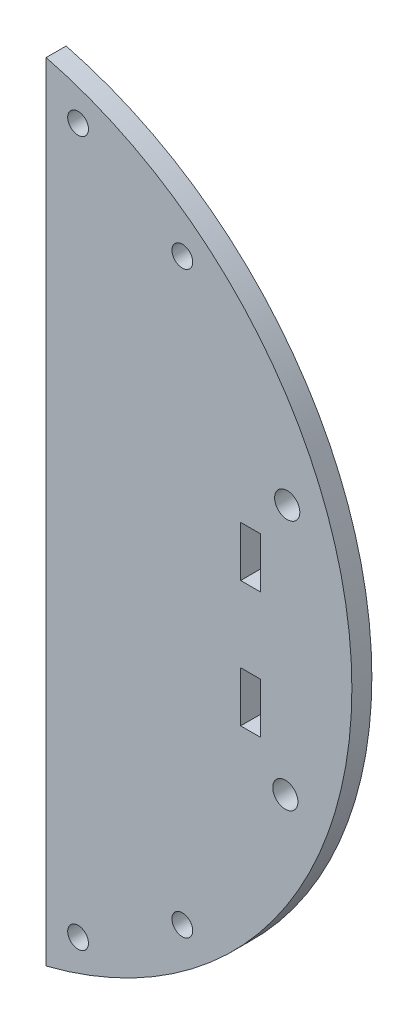
ISO-10303-21;
HEADER;
FILE_DESCRIPTION(('STEP AP214'),'2;1');
FILE_NAME('part.step','',(''),(''),'','','');
FILE_SCHEMA(('AUTOMOTIVE_DESIGN { 1 0 10303 214 1 1 1 1 }'));
ENDSEC;
DATA;
#1=APPLICATION_CONTEXT('core data for automotive mechanical design processes');
#2=APPLICATION_PROTOCOL_DEFINITION('international standard','automotive_design',2000,#1);
#3=PRODUCT_CONTEXT('',#1,'mechanical');
#4=PRODUCT('Part','Part','',(#3));
#5=PRODUCT_RELATED_PRODUCT_CATEGORY('part','',(#4));
#6=PRODUCT_DEFINITION_FORMATION('','',#4);
#7=PRODUCT_DEFINITION_CONTEXT('part definition',#1,'design');
#8=PRODUCT_DEFINITION('design','',#6,#7);
#9=PRODUCT_DEFINITION_SHAPE('','',#8);
#10=(LENGTH_UNIT() NAMED_UNIT(*) SI_UNIT(.MILLI.,.METRE.));
#11=(NAMED_UNIT(*) PLANE_ANGLE_UNIT() SI_UNIT($,.RADIAN.));
#12=(NAMED_UNIT(*) SI_UNIT($,.STERADIAN.) SOLID_ANGLE_UNIT());
#13=UNCERTAINTY_MEASURE_WITH_UNIT(LENGTH_MEASURE(1.E-05),#10,'distance_accuracy_value','');
#14=(GEOMETRIC_REPRESENTATION_CONTEXT(3) GLOBAL_UNCERTAINTY_ASSIGNED_CONTEXT((#13)) GLOBAL_UNIT_ASSIGNED_CONTEXT((#10,
#11,#12)) REPRESENTATION_CONTEXT('',''));
#15=CARTESIAN_POINT('',(0.,0.,0.));
#16=DIRECTION('',(0.,0.,1.));
#17=DIRECTION('',(1.,0.,0.));
#18=AXIS2_PLACEMENT_3D('',#15,#16,#17);
#19=CARTESIAN_POINT('',(-15.925,-0.366425757688034,3.175));
#20=DIRECTION('',(0.,0.,1.));
#21=DIRECTION('',(1.,0.,0.));
#22=AXIS2_PLACEMENT_3D('',#19,#20,#21);
#23=PLANE('',#22);
#24=DIRECTION('',(0.,1.,0.));
#25=VECTOR('',#24,1.);
#26=CARTESIAN_POINT('',(34.075,13.633574242312,3.175));
#27=LINE('',#26,#25);
#28=CARTESIAN_POINT('',(34.075,5.63357424231197,3.175));
#29=VERTEX_POINT('',#28);
#30=CARTESIAN_POINT('',(34.075,13.633574242312,3.175));
#31=VERTEX_POINT('',#30);
#32=EDGE_CURVE('E47',#29,#31,#27,.T.);
#33=ORIENTED_EDGE('',*,*,#32,.F.);
#34=DIRECTION('',(1.,0.,0.));
#35=VECTOR('',#34,1.);
#36=CARTESIAN_POINT('',(30.9,5.63357424231197,3.175));
#37=LINE('',#36,#35);
#38=CARTESIAN_POINT('',(30.9,5.63357424231197,3.175));
#39=VERTEX_POINT('',#38);
#40=EDGE_CURVE('E130',#39,#29,#37,.T.);
#41=ORIENTED_EDGE('',*,*,#40,.F.);
#42=DIRECTION('',(0.,-1.,0.));
#43=VECTOR('',#42,1.);
#44=CARTESIAN_POINT('',(30.9,13.633574242312,3.175));
#45=LINE('',#44,#43);
#46=CARTESIAN_POINT('',(30.9,13.633574242312,3.175));
#47=VERTEX_POINT('',#46);
#48=EDGE_CURVE('E133',#47,#39,#45,.T.);
#49=ORIENTED_EDGE('',*,*,#48,.F.);
#50=DIRECTION('',(-1.,0.,0.));
#51=VECTOR('',#50,1.);
#52=CARTESIAN_POINT('',(30.9,13.633574242312,3.175));
#53=LINE('',#52,#51);
#54=EDGE_CURVE('E139',#31,#47,#53,.T.);
#55=ORIENTED_EDGE('',*,*,#54,.F.);
#56=EDGE_LOOP('',(#33,#41,#49,#55));
#57=FACE_BOUND('',#56,.T.);
#58=DIRECTION('',(0.,-1.,0.));
#59=VECTOR('',#58,1.);
#60=CARTESIAN_POINT('',(30.9,-14.366425757688,3.175));
#61=LINE('',#60,#59);
#62=CARTESIAN_POINT('',(30.9,-6.36642575768803,3.175));
#63=VERTEX_POINT('',#62);
#64=CARTESIAN_POINT('',(30.9,-14.366425757688,3.175));
#65=VERTEX_POINT('',#64);
#66=EDGE_CURVE('E55',#63,#65,#61,.T.);
#67=ORIENTED_EDGE('',*,*,#66,.F.);
#68=DIRECTION('',(-1.,0.,0.));
#69=VECTOR('',#68,1.);
#70=CARTESIAN_POINT('',(30.9,-6.36642575768803,3.175));
#71=LINE('',#70,#69);
#72=CARTESIAN_POINT('',(34.075,-6.36642575768803,3.175));
#73=VERTEX_POINT('',#72);
#74=EDGE_CURVE('E154',#73,#63,#71,.T.);
#75=ORIENTED_EDGE('',*,*,#74,.F.);
#76=DIRECTION('',(0.,1.,0.));
#77=VECTOR('',#76,1.);
#78=CARTESIAN_POINT('',(34.075,-14.366425757688,3.175));
#79=LINE('',#78,#77);
#80=CARTESIAN_POINT('',(34.075,-14.366425757688,3.175));
#81=VERTEX_POINT('',#80);
#82=EDGE_CURVE('E168',#81,#73,#79,.T.);
#83=ORIENTED_EDGE('',*,*,#82,.F.);
#84=DIRECTION('',(1.,0.,0.));
#85=VECTOR('',#84,1.);
#86=CARTESIAN_POINT('',(30.9,-14.366425757688,3.175));
#87=LINE('',#86,#85);
#88=EDGE_CURVE('E165',#65,#81,#87,.T.);
#89=ORIENTED_EDGE('',*,*,#88,.F.);
#90=EDGE_LOOP('',(#67,#75,#83,#89));
#91=FACE_BOUND('',#90,.T.);
#92=CARTESIAN_POINT('',(5.075,55.633574242312,3.175));
#93=DIRECTION('',(0.,0.,1.));
#94=DIRECTION('',(-1.,0.,0.));
#95=AXIS2_PLACEMENT_3D('',#92,#93,#94);
#96=CIRCLE('',#95,1.65);
#97=CARTESIAN_POINT('',(3.425,55.633574242312,3.175));
#98=VERTEX_POINT('',#97);
#99=EDGE_CURVE('E185',#98,#98,#96,.T.);
#100=ORIENTED_EDGE('',*,*,#99,.F.);
#101=EDGE_LOOP('',(#100));
#102=FACE_BOUND('',#101,.T.);
#103=CARTESIAN_POINT('',(21.6384711955131,-46.366425757688,3.175));
#104=DIRECTION('',(0.,0.,1.));
#105=DIRECTION('',(1.,0.,0.));
#106=AXIS2_PLACEMENT_3D('',#103,#104,#105);
#107=CIRCLE('',#106,1.65);
#108=CARTESIAN_POINT('',(23.2884711955131,-46.366425757688,3.175));
#109=VERTEX_POINT('',#108);
#110=EDGE_CURVE('E197',#109,#109,#107,.T.);
#111=ORIENTED_EDGE('',*,*,#110,.F.);
#112=EDGE_LOOP('',(#111));
#113=FACE_BOUND('',#112,.T.);
#114=CARTESIAN_POINT('',(38.,-20.2872222283984,3.175));
#115=DIRECTION('',(0.,0.,1.));
#116=DIRECTION('',(1.,0.,0.));
#117=AXIS2_PLACEMENT_3D('',#114,#115,#116);
#118=CIRCLE('',#117,2.);
#119=CARTESIAN_POINT('',(40.,-20.2872222283984,3.175));
#120=VERTEX_POINT('',#119);
#121=EDGE_CURVE('E209',#120,#120,#118,.T.);
#122=ORIENTED_EDGE('',*,*,#121,.F.);
#123=EDGE_LOOP('',(#122));
#124=FACE_BOUND('',#123,.T.);
#125=CARTESIAN_POINT('',(-15.925,-0.366425757688034,3.175));
#126=DIRECTION('',(0.,0.,1.));
#127=DIRECTION('',(1.,0.,0.));
#128=AXIS2_PLACEMENT_3D('',#125,#126,#127);
#129=CIRCLE('',#128,64.5);
#130=CARTESIAN_POINT('',(0.,-62.8695806780598,3.175));
#131=VERTEX_POINT('',#130);
#132=CARTESIAN_POINT('',(0.,62.1367291626838,3.175));
#133=VERTEX_POINT('',#132);
#134=EDGE_CURVE('E215',#131,#133,#129,.T.);
#135=ORIENTED_EDGE('',*,*,#134,.T.);
#136=DIRECTION('',(0.,-1.,0.));
#137=VECTOR('',#136,1.);
#138=CARTESIAN_POINT('',(0.,62.1367291626838,3.175));
#139=LINE('',#138,#137);
#140=EDGE_CURVE('E218',#133,#131,#139,.T.);
#141=ORIENTED_EDGE('',*,*,#140,.T.);
#142=EDGE_LOOP('',(#135,#141));
#143=FACE_BOUND('',#142,.T.);
#144=CARTESIAN_POINT('',(38.3017316170882,19.7116397308029,3.175));
#145=DIRECTION('',(0.,0.,1.));
#146=DIRECTION('',(-1.,0.,0.));
#147=AXIS2_PLACEMENT_3D('',#144,#145,#146);
#148=CIRCLE('',#147,1.99999999999999);
#149=CARTESIAN_POINT('',(36.3017316170882,19.7116397308029,3.175));
#150=VERTEX_POINT('',#149);
#151=EDGE_CURVE('E203',#150,#150,#148,.T.);
#152=ORIENTED_EDGE('',*,*,#151,.F.);
#153=EDGE_LOOP('',(#152));
#154=FACE_BOUND('',#153,.T.);
#155=CARTESIAN_POINT('',(5.07500000000001,-56.366425757688,3.175));
#156=DIRECTION('',(0.,0.,1.));
#157=DIRECTION('',(1.,0.,0.));
#158=AXIS2_PLACEMENT_3D('',#155,#156,#157);
#159=CIRCLE('',#158,1.65);
#160=CARTESIAN_POINT('',(6.72500000000001,-56.366425757688,3.175));
#161=VERTEX_POINT('',#160);
#162=EDGE_CURVE('E191',#161,#161,#159,.T.);
#163=ORIENTED_EDGE('',*,*,#162,.F.);
#164=EDGE_LOOP('',(#163));
#165=FACE_BOUND('',#164,.T.);
#166=CARTESIAN_POINT('',(21.6384711955131,45.633574242312,3.175));
#167=DIRECTION('',(0.,0.,1.));
#168=DIRECTION('',(-1.,0.,0.));
#169=AXIS2_PLACEMENT_3D('',#166,#167,#168);
#170=CIRCLE('',#169,1.65);
#171=CARTESIAN_POINT('',(19.9884711955131,45.633574242312,3.175));
#172=VERTEX_POINT('',#171);
#173=EDGE_CURVE('E179',#172,#172,#170,.T.);
#174=ORIENTED_EDGE('',*,*,#173,.F.);
#175=EDGE_LOOP('',(#174));
#176=FACE_BOUND('',#175,.T.);
#177=ADVANCED_FACE('F32',(#57,#91,#102,#113,#124,#143,#154,#165,#176),#23,.T.);
#178=CARTESIAN_POINT('',(-15.925,-0.366425757688034,0.));
#179=DIRECTION('',(0.,0.,1.));
#180=DIRECTION('',(1.,0.,0.));
#181=AXIS2_PLACEMENT_3D('',#178,#179,#180);
#182=PLANE('',#181);
#183=DIRECTION('',(1.,0.,0.));
#184=VECTOR('',#183,1.);
#185=CARTESIAN_POINT('',(30.9,5.63357424231197,0.));
#186=LINE('',#185,#184);
#187=CARTESIAN_POINT('',(30.9,5.63357424231197,0.));
#188=VERTEX_POINT('',#187);
#189=CARTESIAN_POINT('',(34.075,5.63357424231197,0.));
#190=VERTEX_POINT('',#189);
#191=EDGE_CURVE('E117',#188,#190,#186,.T.);
#192=ORIENTED_EDGE('',*,*,#191,.T.);
#193=DIRECTION('',(0.,1.,0.));
#194=VECTOR('',#193,1.);
#195=CARTESIAN_POINT('',(34.075,13.633574242312,0.));
#196=LINE('',#195,#194);
#197=CARTESIAN_POINT('',(34.075,13.633574242312,0.));
#198=VERTEX_POINT('',#197);
#199=EDGE_CURVE('E111',#190,#198,#196,.T.);
#200=ORIENTED_EDGE('',*,*,#199,.T.);
#201=DIRECTION('',(-1.,0.,0.));
#202=VECTOR('',#201,1.);
#203=CARTESIAN_POINT('',(30.9,13.633574242312,0.));
#204=LINE('',#203,#202);
#205=CARTESIAN_POINT('',(30.9,13.633574242312,0.));
#206=VERTEX_POINT('',#205);
#207=EDGE_CURVE('E121',#198,#206,#204,.T.);
#208=ORIENTED_EDGE('',*,*,#207,.T.);
#209=DIRECTION('',(0.,-1.,0.));
#210=VECTOR('',#209,1.);
#211=CARTESIAN_POINT('',(30.9,13.633574242312,0.));
#212=LINE('',#211,#210);
#213=EDGE_CURVE('E125',#206,#188,#212,.T.);
#214=ORIENTED_EDGE('',*,*,#213,.T.);
#215=EDGE_LOOP('',(#192,#200,#208,#214));
#216=FACE_BOUND('',#215,.T.);
#217=DIRECTION('',(-1.,0.,0.));
#218=VECTOR('',#217,1.);
#219=CARTESIAN_POINT('',(30.9,-6.36642575768803,0.));
#220=LINE('',#219,#218);
#221=CARTESIAN_POINT('',(34.075,-6.36642575768803,0.));
#222=VERTEX_POINT('',#221);
#223=CARTESIAN_POINT('',(30.9,-6.36642575768803,0.));
#224=VERTEX_POINT('',#223);
#225=EDGE_CURVE('E160',#222,#224,#220,.T.);
#226=ORIENTED_EDGE('',*,*,#225,.T.);
#227=DIRECTION('',(0.,-1.,0.));
#228=VECTOR('',#227,1.);
#229=CARTESIAN_POINT('',(30.9,-14.366425757688,0.));
#230=LINE('',#229,#228);
#231=CARTESIAN_POINT('',(30.9,-14.366425757688,0.));
#232=VERTEX_POINT('',#231);
#233=EDGE_CURVE('E150',#224,#232,#230,.T.);
#234=ORIENTED_EDGE('',*,*,#233,.T.);
#235=DIRECTION('',(1.,0.,0.));
#236=VECTOR('',#235,1.);
#237=CARTESIAN_POINT('',(30.9,-14.366425757688,0.));
#238=LINE('',#237,#236);
#239=CARTESIAN_POINT('',(34.075,-14.366425757688,0.));
#240=VERTEX_POINT('',#239);
#241=EDGE_CURVE('E153',#232,#240,#238,.T.);
#242=ORIENTED_EDGE('',*,*,#241,.T.);
#243=DIRECTION('',(0.,1.,0.));
#244=VECTOR('',#243,1.);
#245=CARTESIAN_POINT('',(34.075,-14.366425757688,0.));
#246=LINE('',#245,#244);
#247=EDGE_CURVE('E157',#240,#222,#246,.T.);
#248=ORIENTED_EDGE('',*,*,#247,.T.);
#249=EDGE_LOOP('',(#226,#234,#242,#248));
#250=FACE_BOUND('',#249,.T.);
#251=CARTESIAN_POINT('',(-15.925,-0.366425757688034,0.));
#252=DIRECTION('',(0.,0.,1.));
#253=DIRECTION('',(1.,0.,0.));
#254=AXIS2_PLACEMENT_3D('',#251,#252,#253);
#255=CIRCLE('',#254,64.5);
#256=CARTESIAN_POINT('',(0.,-62.8695806780598,0.));
#257=VERTEX_POINT('',#256);
#258=CARTESIAN_POINT('',(0.,62.1367291626838,0.));
#259=VERTEX_POINT('',#258);
#260=EDGE_CURVE('E212',#257,#259,#255,.T.);
#261=ORIENTED_EDGE('',*,*,#260,.F.);
#262=DIRECTION('',(0.,-1.,0.));
#263=VECTOR('',#262,1.);
#264=CARTESIAN_POINT('',(0.,62.1367291626838,0.));
#265=LINE('',#264,#263);
#266=EDGE_CURVE('E219',#259,#257,#265,.T.);
#267=ORIENTED_EDGE('',*,*,#266,.F.);
#268=EDGE_LOOP('',(#261,#267));
#269=FACE_BOUND('',#268,.T.);
#270=CARTESIAN_POINT('',(38.,-20.2872222283984,0.));
#271=DIRECTION('',(0.,0.,1.));
#272=DIRECTION('',(1.,0.,0.));
#273=AXIS2_PLACEMENT_3D('',#270,#271,#272);
#274=CIRCLE('',#273,2.);
#275=CARTESIAN_POINT('',(40.,-20.2872222283984,0.));
#276=VERTEX_POINT('',#275);
#277=EDGE_CURVE('E206',#276,#276,#274,.T.);
#278=ORIENTED_EDGE('',*,*,#277,.T.);
#279=EDGE_LOOP('',(#278));
#280=FACE_BOUND('',#279,.T.);
#281=CARTESIAN_POINT('',(38.3017316170882,19.7116397308029,0.));
#282=DIRECTION('',(0.,0.,1.));
#283=DIRECTION('',(-1.,0.,0.));
#284=AXIS2_PLACEMENT_3D('',#281,#282,#283);
#285=CIRCLE('',#284,1.99999999999999);
#286=CARTESIAN_POINT('',(36.3017316170882,19.7116397308029,0.));
#287=VERTEX_POINT('',#286);
#288=EDGE_CURVE('E200',#287,#287,#285,.T.);
#289=ORIENTED_EDGE('',*,*,#288,.T.);
#290=EDGE_LOOP('',(#289));
#291=FACE_BOUND('',#290,.T.);
#292=CARTESIAN_POINT('',(21.6384711955131,-46.366425757688,0.));
#293=DIRECTION('',(0.,0.,1.));
#294=DIRECTION('',(1.,0.,0.));
#295=AXIS2_PLACEMENT_3D('',#292,#293,#294);
#296=CIRCLE('',#295,1.65);
#297=CARTESIAN_POINT('',(23.2884711955131,-46.366425757688,0.));
#298=VERTEX_POINT('',#297);
#299=EDGE_CURVE('E194',#298,#298,#296,.T.);
#300=ORIENTED_EDGE('',*,*,#299,.T.);
#301=EDGE_LOOP('',(#300));
#302=FACE_BOUND('',#301,.T.);
#303=CARTESIAN_POINT('',(5.07500000000001,-56.366425757688,0.));
#304=DIRECTION('',(0.,0.,1.));
#305=DIRECTION('',(1.,0.,0.));
#306=AXIS2_PLACEMENT_3D('',#303,#304,#305);
#307=CIRCLE('',#306,1.65);
#308=CARTESIAN_POINT('',(6.72500000000001,-56.366425757688,0.));
#309=VERTEX_POINT('',#308);
#310=EDGE_CURVE('E188',#309,#309,#307,.T.);
#311=ORIENTED_EDGE('',*,*,#310,.T.);
#312=EDGE_LOOP('',(#311));
#313=FACE_BOUND('',#312,.T.);
#314=CARTESIAN_POINT('',(5.075,55.633574242312,0.));
#315=DIRECTION('',(0.,0.,1.));
#316=DIRECTION('',(-1.,0.,0.));
#317=AXIS2_PLACEMENT_3D('',#314,#315,#316);
#318=CIRCLE('',#317,1.65);
#319=CARTESIAN_POINT('',(3.425,55.633574242312,0.));
#320=VERTEX_POINT('',#319);
#321=EDGE_CURVE('E182',#320,#320,#318,.T.);
#322=ORIENTED_EDGE('',*,*,#321,.T.);
#323=EDGE_LOOP('',(#322));
#324=FACE_BOUND('',#323,.T.);
#325=CARTESIAN_POINT('',(21.6384711955131,45.633574242312,0.));
#326=DIRECTION('',(0.,0.,1.));
#327=DIRECTION('',(-1.,0.,0.));
#328=AXIS2_PLACEMENT_3D('',#325,#326,#327);
#329=CIRCLE('',#328,1.65);
#330=CARTESIAN_POINT('',(19.9884711955131,45.633574242312,0.));
#331=VERTEX_POINT('',#330);
#332=EDGE_CURVE('E146',#331,#331,#329,.T.);
#333=ORIENTED_EDGE('',*,*,#332,.T.);
#334=EDGE_LOOP('',(#333));
#335=FACE_BOUND('',#334,.T.);
#336=ADVANCED_FACE('F127',(#216,#250,#269,#280,#291,#302,#313,#324,#335),#182,.F.);
#337=CARTESIAN_POINT('',(-15.925,-0.366425757688034,3.175));
#338=DIRECTION('',(0.,0.,-1.));
#339=DIRECTION('',(-1.,0.,0.));
#340=AXIS2_PLACEMENT_3D('',#337,#338,#339);
#341=CYLINDRICAL_SURFACE('',#340,64.5);
#342=ORIENTED_EDGE('',*,*,#260,.T.);
#343=DIRECTION('',(0.,0.,-1.));
#344=VECTOR('',#343,1.);
#345=CARTESIAN_POINT('',(0.,62.1367291626838,3.175));
#346=LINE('',#345,#344);
#347=EDGE_CURVE('E11',#133,#259,#346,.T.);
#348=ORIENTED_EDGE('',*,*,#347,.F.);
#349=ORIENTED_EDGE('',*,*,#134,.F.);
#350=DIRECTION('',(0.,0.,-1.));
#351=VECTOR('',#350,1.);
#352=CARTESIAN_POINT('',(0.,-62.8695806780598,3.175));
#353=LINE('',#352,#351);
#354=EDGE_CURVE('E40',#131,#257,#353,.T.);
#355=ORIENTED_EDGE('',*,*,#354,.T.);
#356=EDGE_LOOP('',(#342,#348,#349,#355));
#357=FACE_BOUND('',#356,.T.);
#358=ADVANCED_FACE('F34',(#357),#341,.T.);
#359=CARTESIAN_POINT('',(0.,62.1367291626838,3.175));
#360=DIRECTION('',(1.,0.,0.));
#361=DIRECTION('',(0.,0.,-1.));
#362=AXIS2_PLACEMENT_3D('',#359,#360,#361);
#363=PLANE('',#362);
#364=ORIENTED_EDGE('',*,*,#266,.T.);
#365=ORIENTED_EDGE('',*,*,#354,.F.);
#366=ORIENTED_EDGE('',*,*,#140,.F.);
#367=ORIENTED_EDGE('',*,*,#347,.T.);
#368=EDGE_LOOP('',(#364,#365,#366,#367));
#369=FACE_BOUND('',#368,.T.);
#370=ADVANCED_FACE('F232',(#369),#363,.F.);
#371=CARTESIAN_POINT('',(38.,-20.2872222283984,3.175));
#372=DIRECTION('',(0.,0.,-1.));
#373=DIRECTION('',(-1.,0.,0.));
#374=AXIS2_PLACEMENT_3D('',#371,#372,#373);
#375=CYLINDRICAL_SURFACE('',#374,2.);
#376=ORIENTED_EDGE('',*,*,#121,.T.);
#377=EDGE_LOOP('',(#376));
#378=FACE_BOUND('',#377,.T.);
#379=ORIENTED_EDGE('',*,*,#277,.F.);
#380=EDGE_LOOP('',(#379));
#381=FACE_BOUND('',#380,.T.);
#382=ADVANCED_FACE('F260',(#378,#381),#375,.F.);
#383=CARTESIAN_POINT('',(38.3017316170882,19.7116397308029,3.175));
#384=DIRECTION('',(0.,0.,-1.));
#385=DIRECTION('',(-1.,0.,0.));
#386=AXIS2_PLACEMENT_3D('',#383,#384,#385);
#387=CYLINDRICAL_SURFACE('',#386,1.99999999999999);
#388=ORIENTED_EDGE('',*,*,#151,.T.);
#389=EDGE_LOOP('',(#388));
#390=FACE_BOUND('',#389,.T.);
#391=ORIENTED_EDGE('',*,*,#288,.F.);
#392=EDGE_LOOP('',(#391));
#393=FACE_BOUND('',#392,.T.);
#394=ADVANCED_FACE('F264',(#390,#393),#387,.F.);
#395=CARTESIAN_POINT('',(21.6384711955131,-46.366425757688,3.175));
#396=DIRECTION('',(0.,0.,-1.));
#397=DIRECTION('',(-1.,0.,0.));
#398=AXIS2_PLACEMENT_3D('',#395,#396,#397);
#399=CYLINDRICAL_SURFACE('',#398,1.65);
#400=ORIENTED_EDGE('',*,*,#110,.T.);
#401=EDGE_LOOP('',(#400));
#402=FACE_BOUND('',#401,.T.);
#403=ORIENTED_EDGE('',*,*,#299,.F.);
#404=EDGE_LOOP('',(#403));
#405=FACE_BOUND('',#404,.T.);
#406=ADVANCED_FACE('F269',(#402,#405),#399,.F.);
#407=CARTESIAN_POINT('',(5.07500000000001,-56.366425757688,3.175));
#408=DIRECTION('',(0.,0.,-1.));
#409=DIRECTION('',(-1.,0.,0.));
#410=AXIS2_PLACEMENT_3D('',#407,#408,#409);
#411=CYLINDRICAL_SURFACE('',#410,1.65);
#412=ORIENTED_EDGE('',*,*,#162,.T.);
#413=EDGE_LOOP('',(#412));
#414=FACE_BOUND('',#413,.T.);
#415=ORIENTED_EDGE('',*,*,#310,.F.);
#416=EDGE_LOOP('',(#415));
#417=FACE_BOUND('',#416,.T.);
#418=ADVANCED_FACE('F276',(#414,#417),#411,.F.);
#419=CARTESIAN_POINT('',(5.075,55.633574242312,3.175));
#420=DIRECTION('',(0.,0.,-1.));
#421=DIRECTION('',(-1.,0.,0.));
#422=AXIS2_PLACEMENT_3D('',#419,#420,#421);
#423=CYLINDRICAL_SURFACE('',#422,1.65);
#424=ORIENTED_EDGE('',*,*,#99,.T.);
#425=EDGE_LOOP('',(#424));
#426=FACE_BOUND('',#425,.T.);
#427=ORIENTED_EDGE('',*,*,#321,.F.);
#428=EDGE_LOOP('',(#427));
#429=FACE_BOUND('',#428,.T.);
#430=ADVANCED_FACE('F248',(#426,#429),#423,.F.);
#431=CARTESIAN_POINT('',(21.6384711955131,45.633574242312,3.175));
#432=DIRECTION('',(0.,0.,-1.));
#433=DIRECTION('',(-1.,0.,0.));
#434=AXIS2_PLACEMENT_3D('',#431,#432,#433);
#435=CYLINDRICAL_SURFACE('',#434,1.65);
#436=ORIENTED_EDGE('',*,*,#173,.T.);
#437=EDGE_LOOP('',(#436));
#438=FACE_BOUND('',#437,.T.);
#439=ORIENTED_EDGE('',*,*,#332,.F.);
#440=EDGE_LOOP('',(#439));
#441=FACE_BOUND('',#440,.T.);
#442=ADVANCED_FACE('F244',(#438,#441),#435,.F.);
#443=CARTESIAN_POINT('',(30.9,-14.366425757688,0.));
#444=DIRECTION('',(-1.,0.,0.));
#445=DIRECTION('',(0.,-1.,0.));
#446=AXIS2_PLACEMENT_3D('',#443,#444,#445);
#447=PLANE('',#446);
#448=ORIENTED_EDGE('',*,*,#66,.T.);
#449=DIRECTION('',(0.,0.,1.));
#450=VECTOR('',#449,1.);
#451=CARTESIAN_POINT('',(30.9,-14.366425757688,0.));
#452=LINE('',#451,#450);
#453=EDGE_CURVE('E163',#232,#65,#452,.T.);
#454=ORIENTED_EDGE('',*,*,#453,.F.);
#455=ORIENTED_EDGE('',*,*,#233,.F.);
#456=DIRECTION('',(0.,0.,1.));
#457=VECTOR('',#456,1.);
#458=CARTESIAN_POINT('',(30.9,-6.36642575768803,0.));
#459=LINE('',#458,#457);
#460=EDGE_CURVE('E140',#224,#63,#459,.T.);
#461=ORIENTED_EDGE('',*,*,#460,.T.);
#462=EDGE_LOOP('',(#448,#454,#455,#461));
#463=FACE_BOUND('',#462,.T.);
#464=ADVANCED_FACE('F247',(#463),#447,.F.);
#465=CARTESIAN_POINT('',(30.9,-6.36642575768803,0.));
#466=DIRECTION('',(0.,1.,0.));
#467=DIRECTION('',(0.,0.,1.));
#468=AXIS2_PLACEMENT_3D('',#465,#466,#467);
#469=PLANE('',#468);
#470=ORIENTED_EDGE('',*,*,#74,.T.);
#471=ORIENTED_EDGE('',*,*,#460,.F.);
#472=ORIENTED_EDGE('',*,*,#225,.F.);
#473=DIRECTION('',(0.,0.,1.));
#474=VECTOR('',#473,1.);
#475=CARTESIAN_POINT('',(34.075,-6.36642575768803,0.));
#476=LINE('',#475,#474);
#477=EDGE_CURVE('E174',#222,#73,#476,.T.);
#478=ORIENTED_EDGE('',*,*,#477,.T.);
#479=EDGE_LOOP('',(#470,#471,#472,#478));
#480=FACE_BOUND('',#479,.T.);
#481=ADVANCED_FACE('F286',(#480),#469,.F.);
#482=CARTESIAN_POINT('',(34.075,-14.366425757688,0.));
#483=DIRECTION('',(1.,0.,0.));
#484=DIRECTION('',(0.,0.,-1.));
#485=AXIS2_PLACEMENT_3D('',#482,#483,#484);
#486=PLANE('',#485);
#487=ORIENTED_EDGE('',*,*,#82,.T.);
#488=ORIENTED_EDGE('',*,*,#477,.F.);
#489=ORIENTED_EDGE('',*,*,#247,.F.);
#490=DIRECTION('',(0.,0.,1.));
#491=VECTOR('',#490,1.);
#492=CARTESIAN_POINT('',(34.075,-14.366425757688,0.));
#493=LINE('',#492,#491);
#494=EDGE_CURVE('E176',#240,#81,#493,.T.);
#495=ORIENTED_EDGE('',*,*,#494,.T.);
#496=EDGE_LOOP('',(#487,#488,#489,#495));
#497=FACE_BOUND('',#496,.T.);
#498=ADVANCED_FACE('F290',(#497),#486,.F.);
#499=CARTESIAN_POINT('',(30.9,-14.366425757688,0.));
#500=DIRECTION('',(0.,-1.,0.));
#501=DIRECTION('',(0.,0.,-1.));
#502=AXIS2_PLACEMENT_3D('',#499,#500,#501);
#503=PLANE('',#502);
#504=ORIENTED_EDGE('',*,*,#88,.T.);
#505=ORIENTED_EDGE('',*,*,#494,.F.);
#506=ORIENTED_EDGE('',*,*,#241,.F.);
#507=ORIENTED_EDGE('',*,*,#453,.T.);
#508=EDGE_LOOP('',(#504,#505,#506,#507));
#509=FACE_BOUND('',#508,.T.);
#510=ADVANCED_FACE('F287',(#509),#503,.F.);
#511=CARTESIAN_POINT('',(34.075,13.633574242312,0.));
#512=DIRECTION('',(1.,0.,0.));
#513=DIRECTION('',(0.,0.,-1.));
#514=AXIS2_PLACEMENT_3D('',#511,#512,#513);
#515=PLANE('',#514);
#516=ORIENTED_EDGE('',*,*,#32,.T.);
#517=DIRECTION('',(0.,0.,1.));
#518=VECTOR('',#517,1.);
#519=CARTESIAN_POINT('',(34.075,13.633574242312,0.));
#520=LINE('',#519,#518);
#521=EDGE_CURVE('E107',#198,#31,#520,.T.);
#522=ORIENTED_EDGE('',*,*,#521,.F.);
#523=ORIENTED_EDGE('',*,*,#199,.F.);
#524=DIRECTION('',(0.,0.,1.));
#525=VECTOR('',#524,1.);
#526=CARTESIAN_POINT('',(34.075,5.63357424231197,0.));
#527=LINE('',#526,#525);
#528=EDGE_CURVE('E144',#190,#29,#527,.T.);
#529=ORIENTED_EDGE('',*,*,#528,.T.);
#530=EDGE_LOOP('',(#516,#522,#523,#529));
#531=FACE_BOUND('',#530,.T.);
#532=ADVANCED_FACE('F109',(#531),#515,.F.);
#533=CARTESIAN_POINT('',(30.9,5.63357424231197,0.));
#534=DIRECTION('',(0.,-1.,0.));
#535=DIRECTION('',(0.,0.,-1.));
#536=AXIS2_PLACEMENT_3D('',#533,#534,#535);
#537=PLANE('',#536);
#538=ORIENTED_EDGE('',*,*,#40,.T.);
#539=ORIENTED_EDGE('',*,*,#528,.F.);
#540=ORIENTED_EDGE('',*,*,#191,.F.);
#541=DIRECTION('',(0.,0.,1.));
#542=VECTOR('',#541,1.);
#543=CARTESIAN_POINT('',(30.9,5.63357424231197,0.));
#544=LINE('',#543,#542);
#545=EDGE_CURVE('E147',#188,#39,#544,.T.);
#546=ORIENTED_EDGE('',*,*,#545,.T.);
#547=EDGE_LOOP('',(#538,#539,#540,#546));
#548=FACE_BOUND('',#547,.T.);
#549=ADVANCED_FACE('F300',(#548),#537,.F.);
#550=CARTESIAN_POINT('',(30.9,13.633574242312,0.));
#551=DIRECTION('',(-1.,0.,0.));
#552=DIRECTION('',(0.,-1.,0.));
#553=AXIS2_PLACEMENT_3D('',#550,#551,#552);
#554=PLANE('',#553);
#555=ORIENTED_EDGE('',*,*,#48,.T.);
#556=ORIENTED_EDGE('',*,*,#545,.F.);
#557=ORIENTED_EDGE('',*,*,#213,.F.);
#558=DIRECTION('',(0.,0.,1.));
#559=VECTOR('',#558,1.);
#560=CARTESIAN_POINT('',(30.9,13.633574242312,0.));
#561=LINE('',#560,#559);
#562=EDGE_CURVE('E116',#206,#47,#561,.T.);
#563=ORIENTED_EDGE('',*,*,#562,.T.);
#564=EDGE_LOOP('',(#555,#556,#557,#563));
#565=FACE_BOUND('',#564,.T.);
#566=ADVANCED_FACE('F303',(#565),#554,.F.);
#567=CARTESIAN_POINT('',(30.9,13.633574242312,0.));
#568=DIRECTION('',(0.,1.,0.));
#569=DIRECTION('',(0.,0.,1.));
#570=AXIS2_PLACEMENT_3D('',#567,#568,#569);
#571=PLANE('',#570);
#572=ORIENTED_EDGE('',*,*,#54,.T.);
#573=ORIENTED_EDGE('',*,*,#562,.F.);
#574=ORIENTED_EDGE('',*,*,#207,.F.);
#575=ORIENTED_EDGE('',*,*,#521,.T.);
#576=EDGE_LOOP('',(#572,#573,#574,#575));
#577=FACE_BOUND('',#576,.T.);
#578=ADVANCED_FACE('F122',(#577),#571,.F.);
#579=CLOSED_SHELL('',(#177,#336,#358,#370,#382,#394,#406,#418,#430,#442,#464,#481,#498,#510,
#532,#549,#566,#578));
#580=MANIFOLD_SOLID_BREP('B2',#579);
#581=ADVANCED_BREP_SHAPE_REPRESENTATION('',(#18,#580),#14);
#582=SHAPE_DEFINITION_REPRESENTATION(#9,#581);
ENDSEC;
END-ISO-10303-21;
